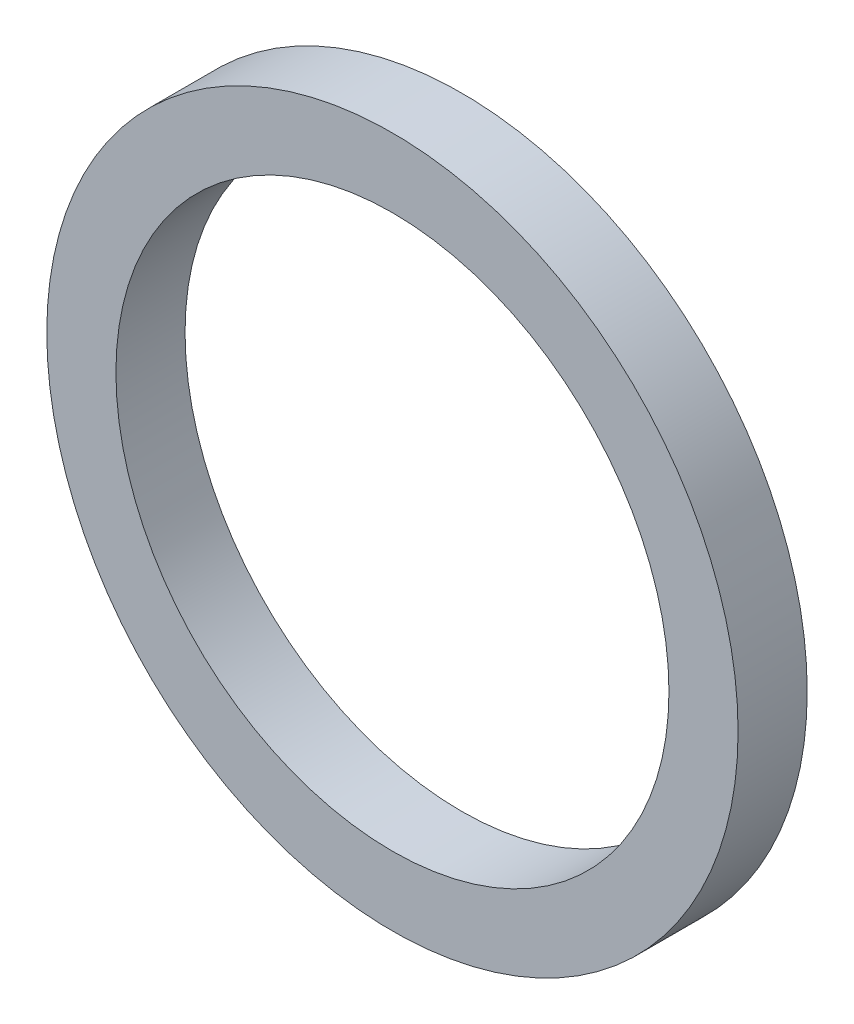
ISO-10303-21;
HEADER;
FILE_DESCRIPTION(('STEP AP214'),'2;1');
FILE_NAME('part.step','',(''),(''),'','','');
FILE_SCHEMA(('AUTOMOTIVE_DESIGN { 1 0 10303 214 1 1 1 1 }'));
ENDSEC;
DATA;
#1=APPLICATION_CONTEXT('core data for automotive mechanical design processes');
#2=APPLICATION_PROTOCOL_DEFINITION('international standard','automotive_design',2000,#1);
#3=PRODUCT_CONTEXT('',#1,'mechanical');
#4=PRODUCT('Part','Part','',(#3));
#5=PRODUCT_RELATED_PRODUCT_CATEGORY('part','',(#4));
#6=PRODUCT_DEFINITION_FORMATION('','',#4);
#7=PRODUCT_DEFINITION_CONTEXT('part definition',#1,'design');
#8=PRODUCT_DEFINITION('design','',#6,#7);
#9=PRODUCT_DEFINITION_SHAPE('','',#8);
#10=(LENGTH_UNIT() NAMED_UNIT(*) SI_UNIT(.MILLI.,.METRE.));
#11=(NAMED_UNIT(*) PLANE_ANGLE_UNIT() SI_UNIT($,.RADIAN.));
#12=(NAMED_UNIT(*) SI_UNIT($,.STERADIAN.) SOLID_ANGLE_UNIT());
#13=UNCERTAINTY_MEASURE_WITH_UNIT(LENGTH_MEASURE(1.E-05),#10,'distance_accuracy_value','');
#14=(GEOMETRIC_REPRESENTATION_CONTEXT(3) GLOBAL_UNCERTAINTY_ASSIGNED_CONTEXT((#13)) GLOBAL_UNIT_ASSIGNED_CONTEXT((#10,
#11,#12)) REPRESENTATION_CONTEXT('',''));
#15=CARTESIAN_POINT('',(0.,0.,0.));
#16=DIRECTION('',(0.,0.,1.));
#17=DIRECTION('',(1.,0.,0.));
#18=AXIS2_PLACEMENT_3D('',#15,#16,#17);
#19=CARTESIAN_POINT('',(0.,0.,1.));
#20=DIRECTION('',(0.,0.,1.));
#21=DIRECTION('',(1.,0.,0.));
#22=AXIS2_PLACEMENT_3D('',#19,#20,#21);
#23=PLANE('',#22);
#24=CARTESIAN_POINT('',(0.,0.,1.));
#25=DIRECTION('',(0.,0.,1.));
#26=DIRECTION('',(1.,0.,0.));
#27=AXIS2_PLACEMENT_3D('',#24,#25,#26);
#28=CIRCLE('',#27,5.);
#29=CARTESIAN_POINT('',(5.,0.,1.));
#30=VERTEX_POINT('',#29);
#31=EDGE_CURVE('E10',#30,#30,#28,.T.);
#32=ORIENTED_EDGE('',*,*,#31,.T.);
#33=EDGE_LOOP('',(#32));
#34=FACE_BOUND('',#33,.T.);
#35=CARTESIAN_POINT('',(0.,0.,1.));
#36=DIRECTION('',(0.,0.,1.));
#37=DIRECTION('',(1.,0.,0.));
#38=AXIS2_PLACEMENT_3D('',#35,#36,#37);
#39=CIRCLE('',#38,4.);
#40=CARTESIAN_POINT('',(4.,0.,1.));
#41=VERTEX_POINT('',#40);
#42=EDGE_CURVE('E50',#41,#41,#39,.T.);
#43=ORIENTED_EDGE('',*,*,#42,.F.);
#44=EDGE_LOOP('',(#43));
#45=FACE_BOUND('',#44,.T.);
#46=ADVANCED_FACE('F37',(#34,#45),#23,.T.);
#47=CARTESIAN_POINT('',(0.,0.,0.));
#48=DIRECTION('',(0.,0.,1.));
#49=DIRECTION('',(1.,0.,0.));
#50=AXIS2_PLACEMENT_3D('',#47,#48,#49);
#51=PLANE('',#50);
#52=CARTESIAN_POINT('',(0.,0.,0.));
#53=DIRECTION('',(0.,0.,1.));
#54=DIRECTION('',(1.,0.,0.));
#55=AXIS2_PLACEMENT_3D('',#52,#53,#54);
#56=CIRCLE('',#55,5.);
#57=CARTESIAN_POINT('',(5.,0.,0.));
#58=VERTEX_POINT('',#57);
#59=EDGE_CURVE('E41',#58,#58,#56,.T.);
#60=ORIENTED_EDGE('',*,*,#59,.F.);
#61=EDGE_LOOP('',(#60));
#62=FACE_BOUND('',#61,.T.);
#63=CARTESIAN_POINT('',(0.,0.,0.));
#64=DIRECTION('',(0.,0.,1.));
#65=DIRECTION('',(1.,0.,0.));
#66=AXIS2_PLACEMENT_3D('',#63,#64,#65);
#67=CIRCLE('',#66,4.);
#68=CARTESIAN_POINT('',(4.,0.,0.));
#69=VERTEX_POINT('',#68);
#70=EDGE_CURVE('E52',#69,#69,#67,.T.);
#71=ORIENTED_EDGE('',*,*,#70,.T.);
#72=EDGE_LOOP('',(#71));
#73=FACE_BOUND('',#72,.T.);
#74=ADVANCED_FACE('F64',(#62,#73),#51,.F.);
#75=CARTESIAN_POINT('',(0.,0.,1.));
#76=DIRECTION('',(0.,0.,-1.));
#77=DIRECTION('',(-1.,0.,0.));
#78=AXIS2_PLACEMENT_3D('',#75,#76,#77);
#79=CYLINDRICAL_SURFACE('',#78,5.);
#80=ORIENTED_EDGE('',*,*,#31,.F.);
#81=EDGE_LOOP('',(#80));
#82=FACE_BOUND('',#81,.T.);
#83=ORIENTED_EDGE('',*,*,#59,.T.);
#84=EDGE_LOOP('',(#83));
#85=FACE_BOUND('',#84,.T.);
#86=ADVANCED_FACE('F39',(#82,#85),#79,.T.);
#87=CARTESIAN_POINT('',(0.,0.,1.));
#88=DIRECTION('',(0.,0.,-1.));
#89=DIRECTION('',(-1.,0.,0.));
#90=AXIS2_PLACEMENT_3D('',#87,#88,#89);
#91=CYLINDRICAL_SURFACE('',#90,4.);
#92=ORIENTED_EDGE('',*,*,#42,.T.);
#93=EDGE_LOOP('',(#92));
#94=FACE_BOUND('',#93,.T.);
#95=ORIENTED_EDGE('',*,*,#70,.F.);
#96=EDGE_LOOP('',(#95));
#97=FACE_BOUND('',#96,.T.);
#98=ADVANCED_FACE('F60',(#94,#97),#91,.F.);
#99=CLOSED_SHELL('',(#46,#74,#86,#98));
#100=MANIFOLD_SOLID_BREP('B2',#99);
#101=ADVANCED_BREP_SHAPE_REPRESENTATION('',(#18,#100),#14);
#102=SHAPE_DEFINITION_REPRESENTATION(#9,#101);
ENDSEC;
END-ISO-10303-21;
